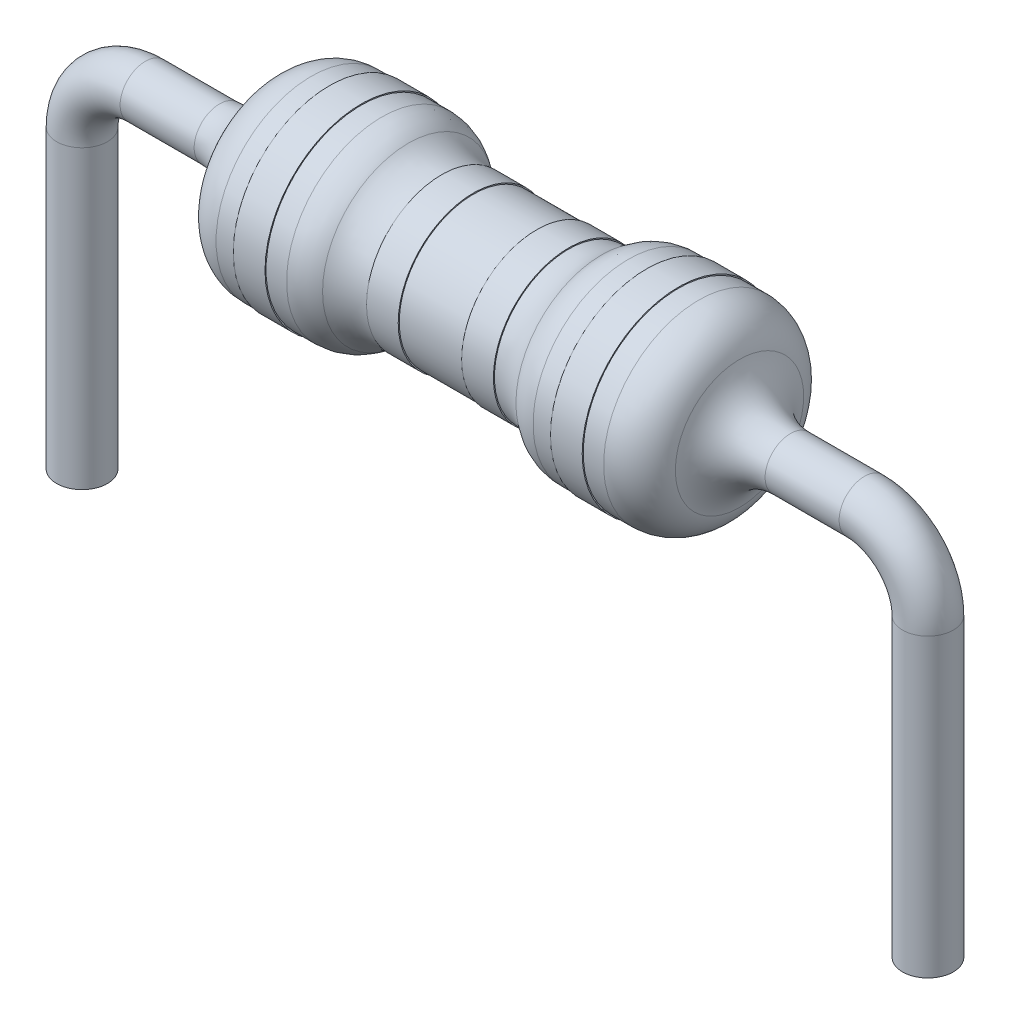
ISO-10303-21;
HEADER;
FILE_DESCRIPTION(('STEP AP214'),'2;1');
FILE_NAME('part.step','',(''),(''),'','','');
FILE_SCHEMA(('AUTOMOTIVE_DESIGN { 1 0 10303 214 1 1 1 1 }'));
ENDSEC;
DATA;
#1=APPLICATION_CONTEXT('core data for automotive mechanical design processes');
#2=APPLICATION_PROTOCOL_DEFINITION('international standard','automotive_design',2000,#1);
#3=PRODUCT_CONTEXT('',#1,'mechanical');
#4=PRODUCT('Part','Part','',(#3));
#5=PRODUCT_RELATED_PRODUCT_CATEGORY('part','',(#4));
#6=PRODUCT_DEFINITION_FORMATION('','',#4);
#7=PRODUCT_DEFINITION_CONTEXT('part definition',#1,'design');
#8=PRODUCT_DEFINITION('design','',#6,#7);
#9=PRODUCT_DEFINITION_SHAPE('','',#8);
#10=(LENGTH_UNIT() NAMED_UNIT(*) SI_UNIT(.MILLI.,.METRE.));
#11=(NAMED_UNIT(*) PLANE_ANGLE_UNIT() SI_UNIT($,.RADIAN.));
#12=(NAMED_UNIT(*) SI_UNIT($,.STERADIAN.) SOLID_ANGLE_UNIT());
#13=UNCERTAINTY_MEASURE_WITH_UNIT(LENGTH_MEASURE(1.E-05),#10,'distance_accuracy_value','');
#14=(GEOMETRIC_REPRESENTATION_CONTEXT(3) GLOBAL_UNCERTAINTY_ASSIGNED_CONTEXT((#13)) GLOBAL_UNIT_ASSIGNED_CONTEXT((#10,
#11,#12)) REPRESENTATION_CONTEXT('',''));
#15=CARTESIAN_POINT('',(0.,0.,0.));
#16=DIRECTION('',(0.,0.,1.));
#17=DIRECTION('',(1.,0.,0.));
#18=AXIS2_PLACEMENT_3D('',#15,#16,#17);
#19=CARTESIAN_POINT('',(-3.21695881901281,1.778,0.));
#20=DIRECTION('',(-1.,0.,0.));
#21=DIRECTION('',(0.,0.,1.));
#22=AXIS2_PLACEMENT_3D('',#19,#20,#21);
#23=CYLINDRICAL_SURFACE('',#22,1.143);
#24=CARTESIAN_POINT('',(6.56042048968553,1.778,0.));
#25=DIRECTION('',(1.,0.,0.));
#26=DIRECTION('',(0.,0.,-1.));
#27=AXIS2_PLACEMENT_3D('',#24,#25,#26);
#28=CIRCLE('',#27,1.143);
#29=CARTESIAN_POINT('',(6.56042048968553,1.778,-1.143));
#30=VERTEX_POINT('',#29);
#31=EDGE_CURVE('E97',#30,#30,#28,.T.);
#32=ORIENTED_EDGE('',*,*,#31,.T.);
#33=EDGE_LOOP('',(#32));
#34=FACE_BOUND('',#33,.T.);
#35=CARTESIAN_POINT('',(6.7818,1.778,0.));
#36=DIRECTION('',(1.,0.,0.));
#37=DIRECTION('',(0.,0.,-1.));
#38=AXIS2_PLACEMENT_3D('',#35,#36,#37);
#39=CIRCLE('',#38,1.143);
#40=CARTESIAN_POINT('',(6.7818,1.778,-1.143));
#41=VERTEX_POINT('',#40);
#42=EDGE_CURVE('E158',#41,#41,#39,.T.);
#43=ORIENTED_EDGE('',*,*,#42,.F.);
#44=EDGE_LOOP('',(#43));
#45=FACE_BOUND('',#44,.T.);
#46=ADVANCED_FACE('F59',(#34,#45),#23,.T.);
#47=CARTESIAN_POINT('',(-3.21695881901281,1.778,0.));
#48=DIRECTION('',(-1.,0.,0.));
#49=DIRECTION('',(0.,0.,1.));
#50=AXIS2_PLACEMENT_3D('',#47,#48,#49);
#51=CYLINDRICAL_SURFACE('',#50,0.889);
#52=CARTESIAN_POINT('',(4.699,1.778,0.));
#53=DIRECTION('',(1.,0.,0.));
#54=DIRECTION('',(0.,0.,-1.));
#55=AXIS2_PLACEMENT_3D('',#52,#53,#54);
#56=CIRCLE('',#55,0.889);
#57=CARTESIAN_POINT('',(4.699,1.778,-0.889));
#58=VERTEX_POINT('',#57);
#59=EDGE_CURVE('E66',#58,#58,#56,.F.);
#60=ORIENTED_EDGE('',*,*,#59,.F.);
#61=EDGE_LOOP('',(#60));
#62=FACE_BOUND('',#61,.T.);
#63=CARTESIAN_POINT('',(5.461,1.778,0.));
#64=DIRECTION('',(1.,0.,0.));
#65=DIRECTION('',(0.,0.,-1.));
#66=AXIS2_PLACEMENT_3D('',#63,#64,#65);
#67=CIRCLE('',#66,0.889);
#68=CARTESIAN_POINT('',(5.461,1.778,-0.889));
#69=VERTEX_POINT('',#68);
#70=EDGE_CURVE('E149',#69,#69,#67,.T.);
#71=ORIENTED_EDGE('',*,*,#70,.F.);
#72=EDGE_LOOP('',(#71));
#73=FACE_BOUND('',#72,.T.);
#74=ADVANCED_FACE('F167',(#62,#73),#51,.T.);
#75=CARTESIAN_POINT('',(-3.21695881901281,1.778,0.));
#76=DIRECTION('',(-1.,0.,0.));
#77=DIRECTION('',(0.,0.,1.));
#78=AXIS2_PLACEMENT_3D('',#75,#76,#77);
#79=CYLINDRICAL_SURFACE('',#78,1.143);
#80=CARTESIAN_POINT('',(3.3528,1.778,0.));
#81=DIRECTION('',(1.,0.,0.));
#82=DIRECTION('',(0.,0.,-1.));
#83=AXIS2_PLACEMENT_3D('',#80,#81,#82);
#84=CIRCLE('',#83,1.143);
#85=CARTESIAN_POINT('',(3.3528,1.778,-1.143));
#86=VERTEX_POINT('',#85);
#87=EDGE_CURVE('E70',#86,#86,#84,.F.);
#88=ORIENTED_EDGE('',*,*,#87,.F.);
#89=EDGE_LOOP('',(#88));
#90=FACE_BOUND('',#89,.T.);
#91=CARTESIAN_POINT('',(3.59957951031447,1.778,0.));
#92=DIRECTION('',(1.,0.,0.));
#93=DIRECTION('',(0.,0.,-1.));
#94=AXIS2_PLACEMENT_3D('',#91,#92,#93);
#95=CIRCLE('',#94,1.143);
#96=CARTESIAN_POINT('',(3.59957951031447,1.778,-1.143));
#97=VERTEX_POINT('',#96);
#98=EDGE_CURVE('E82',#97,#97,#95,.F.);
#99=ORIENTED_EDGE('',*,*,#98,.T.);
#100=EDGE_LOOP('',(#99));
#101=FACE_BOUND('',#100,.T.);
#102=ADVANCED_FACE('F174',(#90,#101),#79,.T.);
#103=CARTESIAN_POINT('',(4.318,1.778,0.));
#104=DIRECTION('',(-1.,0.,0.));
#105=DIRECTION('',(0.,0.,1.));
#106=AXIS2_PLACEMENT_3D('',#103,#104,#105);
#107=TOROIDAL_SURFACE('',#106,1.524,0.635);
#108=CARTESIAN_POINT('',(3.91887750573026,1.778,0.));
#109=DIRECTION('',(1.,0.,0.));
#110=DIRECTION('',(0.,0.,-1.));
#111=AXIS2_PLACEMENT_3D('',#108,#109,#110);
#112=CIRCLE('',#111,1.03011111111111);
#113=CARTESIAN_POINT('',(3.91887750573026,1.778,-1.03011111111111));
#114=VERTEX_POINT('',#113);
#115=EDGE_CURVE('E79',#114,#114,#112,.T.);
#116=ORIENTED_EDGE('',*,*,#115,.T.);
#117=EDGE_LOOP('',(#116));
#118=FACE_BOUND('',#117,.T.);
#119=CARTESIAN_POINT('',(4.318,1.778,0.));
#120=DIRECTION('',(-1.,0.,0.));
#121=DIRECTION('',(0.,0.,1.));
#122=AXIS2_PLACEMENT_3D('',#119,#120,#121);
#123=CIRCLE('',#122,0.889);
#124=CARTESIAN_POINT('',(4.318,1.778,0.889));
#125=VERTEX_POINT('',#124);
#126=EDGE_CURVE('E106',#125,#125,#123,.F.);
#127=ORIENTED_EDGE('',*,*,#126,.F.);
#128=EDGE_LOOP('',(#127));
#129=FACE_BOUND('',#128,.T.);
#130=ADVANCED_FACE('F209',(#118,#129),#107,.F.);
#131=CARTESIAN_POINT('',(3.59957951031447,1.778,0.));
#132=DIRECTION('',(1.,0.,0.));
#133=DIRECTION('',(0.,0.,-1.));
#134=AXIS2_PLACEMENT_3D('',#131,#132,#133);
#135=TOROIDAL_SURFACE('',#134,0.635,0.508);
#136=ORIENTED_EDGE('',*,*,#115,.F.);
#137=EDGE_LOOP('',(#136));
#138=FACE_BOUND('',#137,.T.);
#139=ORIENTED_EDGE('',*,*,#98,.F.);
#140=EDGE_LOOP('',(#139));
#141=FACE_BOUND('',#140,.T.);
#142=ADVANCED_FACE('F206',(#138,#141),#135,.T.);
#143=CARTESIAN_POINT('',(3.3528,1.778,0.));
#144=DIRECTION('',(1.,0.,0.));
#145=DIRECTION('',(0.,0.,-1.));
#146=AXIS2_PLACEMENT_3D('',#143,#144,#145);
#147=PLANE('',#146);
#148=CARTESIAN_POINT('',(3.3528,1.778,0.));
#149=DIRECTION('',(1.,0.,0.));
#150=DIRECTION('',(0.,0.,-1.));
#151=AXIS2_PLACEMENT_3D('',#148,#149,#150);
#152=CIRCLE('',#151,1.1557);
#153=CARTESIAN_POINT('',(3.3528,1.778,1.1557));
#154=VERTEX_POINT('',#153);
#155=EDGE_CURVE('E128',#154,#154,#152,.T.);
#156=ORIENTED_EDGE('',*,*,#155,.T.);
#157=EDGE_LOOP('',(#156));
#158=FACE_BOUND('',#157,.T.);
#159=ORIENTED_EDGE('',*,*,#87,.T.);
#160=EDGE_LOOP('',(#159));
#161=FACE_BOUND('',#160,.T.);
#162=ADVANCED_FACE('F208',(#158,#161),#147,.T.);
#163=CARTESIAN_POINT('',(2.9718,1.778,0.));
#164=DIRECTION('',(1.,0.,0.));
#165=DIRECTION('',(0.,0.,-1.));
#166=AXIS2_PLACEMENT_3D('',#163,#164,#165);
#167=PLANE('',#166);
#168=CARTESIAN_POINT('',(2.9718,1.778,0.));
#169=DIRECTION('',(1.,0.,0.));
#170=DIRECTION('',(0.,0.,-1.));
#171=AXIS2_PLACEMENT_3D('',#168,#169,#170);
#172=CIRCLE('',#171,1.1557);
#173=CARTESIAN_POINT('',(2.9718,1.778,1.1557));
#174=VERTEX_POINT('',#173);
#175=EDGE_CURVE('E131',#174,#174,#172,.T.);
#176=ORIENTED_EDGE('',*,*,#175,.F.);
#177=EDGE_LOOP('',(#176));
#178=FACE_BOUND('',#177,.T.);
#179=CARTESIAN_POINT('',(2.9718,1.778,0.));
#180=DIRECTION('',(1.,0.,0.));
#181=DIRECTION('',(0.,0.,-1.));
#182=AXIS2_PLACEMENT_3D('',#179,#180,#181);
#183=CIRCLE('',#182,1.143);
#184=CARTESIAN_POINT('',(2.9718,1.778,-1.143));
#185=VERTEX_POINT('',#184);
#186=EDGE_CURVE('E134',#185,#185,#183,.T.);
#187=ORIENTED_EDGE('',*,*,#186,.T.);
#188=EDGE_LOOP('',(#187));
#189=FACE_BOUND('',#188,.T.);
#190=ADVANCED_FACE('F215',(#178,#189),#167,.F.);
#191=CARTESIAN_POINT('',(3.3528,1.778,0.));
#192=DIRECTION('',(-1.,0.,0.));
#193=DIRECTION('',(0.,0.,1.));
#194=AXIS2_PLACEMENT_3D('',#191,#192,#193);
#195=CYLINDRICAL_SURFACE('',#194,1.1557);
#196=CARTESIAN_POINT('',(3.3528,1.778,1.1557));
#197=CARTESIAN_POINT('',(3.34883125,1.778,1.1557));
#198=CARTESIAN_POINT('',(3.3448625,1.778,1.1557));
#199=CARTESIAN_POINT('',(3.336925,1.778,1.1557));
#200=CARTESIAN_POINT('',(3.33295625,1.778,1.1557));
#201=CARTESIAN_POINT('',(3.32501875,1.778,1.1557));
#202=CARTESIAN_POINT('',(3.32105,1.778,1.1557));
#203=CARTESIAN_POINT('',(3.3131125,1.778,1.1557));
#204=CARTESIAN_POINT('',(3.30914375,1.778,1.1557));
#205=CARTESIAN_POINT('',(3.30120625,1.778,1.1557));
#206=CARTESIAN_POINT('',(3.2972375,1.778,1.1557));
#207=CARTESIAN_POINT('',(3.2893,1.778,1.1557));
#208=CARTESIAN_POINT('',(3.28533125,1.778,1.1557));
#209=CARTESIAN_POINT('',(3.27739375,1.778,1.1557));
#210=CARTESIAN_POINT('',(3.273425,1.778,1.1557));
#211=CARTESIAN_POINT('',(3.2654875,1.778,1.1557));
#212=CARTESIAN_POINT('',(3.26151875,1.778,1.1557));
#213=CARTESIAN_POINT('',(3.25358125,1.778,1.1557));
#214=CARTESIAN_POINT('',(3.2496125,1.778,1.1557));
#215=CARTESIAN_POINT('',(3.241675,1.778,1.1557));
#216=CARTESIAN_POINT('',(3.23770625,1.778,1.1557));
#217=CARTESIAN_POINT('',(3.22976875,1.778,1.1557));
#218=CARTESIAN_POINT('',(3.2258,1.778,1.1557));
#219=CARTESIAN_POINT('',(3.2178625,1.778,1.1557));
#220=CARTESIAN_POINT('',(3.21389375,1.778,1.1557));
#221=CARTESIAN_POINT('',(3.20595625,1.778,1.1557));
#222=CARTESIAN_POINT('',(3.2019875,1.778,1.1557));
#223=CARTESIAN_POINT('',(3.19405,1.778,1.1557));
#224=CARTESIAN_POINT('',(3.19008125,1.778,1.1557));
#225=CARTESIAN_POINT('',(3.18214375,1.778,1.1557));
#226=CARTESIAN_POINT('',(3.178175,1.778,1.1557));
#227=CARTESIAN_POINT('',(3.1702375,1.778,1.1557));
#228=CARTESIAN_POINT('',(3.16626875,1.778,1.1557));
#229=CARTESIAN_POINT('',(3.15833125,1.778,1.1557));
#230=CARTESIAN_POINT('',(3.1543625,1.778,1.1557));
#231=CARTESIAN_POINT('',(3.146425,1.778,1.1557));
#232=CARTESIAN_POINT('',(3.14245625,1.778,1.1557));
#233=CARTESIAN_POINT('',(3.13451875,1.778,1.1557));
#234=CARTESIAN_POINT('',(3.13055,1.778,1.1557));
#235=CARTESIAN_POINT('',(3.1226125,1.778,1.1557));
#236=CARTESIAN_POINT('',(3.11864375,1.778,1.1557));
#237=CARTESIAN_POINT('',(3.11070625,1.778,1.1557));
#238=CARTESIAN_POINT('',(3.1067375,1.778,1.1557));
#239=CARTESIAN_POINT('',(3.0988,1.778,1.1557));
#240=CARTESIAN_POINT('',(3.09483125,1.778,1.1557));
#241=CARTESIAN_POINT('',(3.08689375,1.778,1.1557));
#242=CARTESIAN_POINT('',(3.082925,1.778,1.1557));
#243=CARTESIAN_POINT('',(3.0749875,1.778,1.1557));
#244=CARTESIAN_POINT('',(3.07101875,1.778,1.1557));
#245=CARTESIAN_POINT('',(3.06308125,1.778,1.1557));
#246=CARTESIAN_POINT('',(3.0591125,1.778,1.1557));
#247=CARTESIAN_POINT('',(3.051175,1.778,1.1557));
#248=CARTESIAN_POINT('',(3.04720625,1.778,1.1557));
#249=CARTESIAN_POINT('',(3.03926875,1.778,1.1557));
#250=CARTESIAN_POINT('',(3.0353,1.778,1.1557));
#251=CARTESIAN_POINT('',(3.0273625,1.778,1.1557));
#252=CARTESIAN_POINT('',(3.02339375,1.778,1.1557));
#253=CARTESIAN_POINT('',(3.01545625,1.778,1.1557));
#254=CARTESIAN_POINT('',(3.0114875,1.778,1.1557));
#255=CARTESIAN_POINT('',(3.00355,1.778,1.1557));
#256=CARTESIAN_POINT('',(2.99958125,1.778,1.1557));
#257=CARTESIAN_POINT('',(2.99164375,1.778,1.1557));
#258=CARTESIAN_POINT('',(2.987675,1.778,1.1557));
#259=CARTESIAN_POINT('',(2.9797375,1.778,1.1557));
#260=CARTESIAN_POINT('',(2.97576875,1.778,1.1557));
#261=CARTESIAN_POINT('',(2.9718,1.778,1.1557));
#262=B_SPLINE_CURVE_WITH_KNOTS('',3,(#196,#197,#198,#199,#200,#201,#202,#203,#204,#205,#206,
#207,#208,#209,#210,#211,#212,#213,#214,#215,#216,#217,#218,#219,#220,#221,#222,#223,#224,#225,
#226,#227,#228,#229,#230,#231,#232,#233,#234,#235,#236,#237,#238,#239,#240,#241,#242,#243,#244,
#245,#246,#247,#248,#249,#250,#251,#252,#253,#254,#255,#256,#257,#258,#259,#260,#261),
.UNSPECIFIED.,.F.,.F.,(4,2,2,2,2,2,2,2,2,2,2,2,2,2,2,2,2,2,2,2,2,2,2,2,2,2,2,2,2,2,2,2,4),(0.,
0.0119062500000002,0.0238125000000004,0.0357187500000002,0.0476250000000004,0.0595312500000001,
0.0714375000000003,0.0833437500000001,0.0952500000000003,0.10715625,0.1190625,0.13096875,
0.142875,0.15478125,0.1666875,0.17859375,0.1905,0.20240625,0.2143125,0.22621875,0.238125,
0.25003125,0.2619375,0.27384375,0.28575,0.29765625,0.3095625,0.32146875,0.333375,0.34528125,
0.3571875,0.36909375,0.381),.UNSPECIFIED.);
#263=EDGE_CURVE('BSEAM247',#154,#174,#262,.T.);
#264=ORIENTED_EDGE('',*,*,#155,.F.);
#265=ORIENTED_EDGE('',*,*,#175,.T.);
#266=ORIENTED_EDGE('',*,*,#263,.T.);
#267=ORIENTED_EDGE('',*,*,#263,.F.);
#268=EDGE_LOOP('',(#264,#266,#265,#267));
#269=FACE_BOUND('',#268,.T.);
#270=ADVANCED_FACE('F247',(#269),#195,.T.);
#271=CARTESIAN_POINT('',(0.,-2.54,0.));
#272=DIRECTION('',(0.,1.,0.));
#273=DIRECTION('',(0.,0.,1.));
#274=AXIS2_PLACEMENT_3D('',#271,#272,#273);
#275=PLANE('',#274);
#276=CARTESIAN_POINT('',(0.,-2.54,0.));
#277=DIRECTION('',(0.,1.,0.));
#278=DIRECTION('',(0.,0.,1.));
#279=AXIS2_PLACEMENT_3D('',#276,#277,#278);
#280=CIRCLE('',#279,0.3048);
#281=CARTESIAN_POINT('',(0.,-2.54,0.3048));
#282=VERTEX_POINT('',#281);
#283=EDGE_CURVE('E125',#282,#282,#280,.T.);
#284=ORIENTED_EDGE('',*,*,#283,.F.);
#285=EDGE_LOOP('',(#284));
#286=FACE_BOUND('',#285,.T.);
#287=ADVANCED_FACE('F253',(#286),#275,.F.);
#288=CARTESIAN_POINT('',(0.,1.016,0.));
#289=DIRECTION('',(0.,-1.,0.));
#290=DIRECTION('',(0.,0.,-1.));
#291=AXIS2_PLACEMENT_3D('',#288,#289,#290);
#292=CYLINDRICAL_SURFACE('',#291,0.3048);
#293=CARTESIAN_POINT('',(0.,1.016,0.));
#294=DIRECTION('',(0.,1.,0.));
#295=DIRECTION('',(0.,0.,1.));
#296=AXIS2_PLACEMENT_3D('',#293,#294,#295);
#297=CIRCLE('',#296,0.3048);
#298=CARTESIAN_POINT('',(-0.3048,1.016,0.));
#299=VERTEX_POINT('',#298);
#300=EDGE_CURVE('E124',#299,#299,#297,.T.);
#301=ORIENTED_EDGE('',*,*,#300,.F.);
#302=EDGE_LOOP('',(#301));
#303=FACE_BOUND('',#302,.T.);
#304=ORIENTED_EDGE('',*,*,#283,.T.);
#305=EDGE_LOOP('',(#304));
#306=FACE_BOUND('',#305,.T.);
#307=ADVANCED_FACE('F313',(#303,#306),#292,.T.);
#308=CARTESIAN_POINT('',(0.762,1.016,0.));
#309=DIRECTION('',(0.,0.,-1.));
#310=DIRECTION('',(-1.,0.,0.));
#311=AXIS2_PLACEMENT_3D('',#308,#309,#310);
#312=TOROIDAL_SURFACE('',#311,0.762,0.3048);
#313=CARTESIAN_POINT('',(0.762,1.778,0.));
#314=DIRECTION('',(1.,0.,0.));
#315=DIRECTION('',(0.,0.,1.));
#316=AXIS2_PLACEMENT_3D('',#313,#314,#315);
#317=CIRCLE('',#316,0.3048);
#318=CARTESIAN_POINT('',(0.762,2.0828,0.));
#319=VERTEX_POINT('',#318);
#320=EDGE_CURVE('E121',#319,#319,#317,.T.);
#321=CARTESIAN_POINT('',(0.762,1.016,0.));
#322=DIRECTION('',(0.,0.,-1.));
#323=DIRECTION('',(-1.,0.,0.));
#324=AXIS2_PLACEMENT_3D('',#321,#322,#323);
#325=CIRCLE('',#324,1.0668);
#326=EDGE_CURVE('',#299,#319,#325,.T.);
#327=ORIENTED_EDGE('',*,*,#300,.T.);
#328=ORIENTED_EDGE('',*,*,#320,.F.);
#329=ORIENTED_EDGE('',*,*,#326,.T.);
#330=ORIENTED_EDGE('',*,*,#326,.F.);
#331=EDGE_LOOP('',(#327,#329,#328,#330));
#332=FACE_BOUND('',#331,.T.);
#333=ADVANCED_FACE('F309',(#332),#312,.T.);
#334=CARTESIAN_POINT('',(0.762,1.778,0.));
#335=DIRECTION('',(1.,0.,0.));
#336=DIRECTION('',(0.,1.,0.));
#337=AXIS2_PLACEMENT_3D('',#334,#335,#336);
#338=CYLINDRICAL_SURFACE('',#337,0.3048);
#339=CARTESIAN_POINT('',(1.651,1.778,0.));
#340=DIRECTION('',(-1.,0.,0.));
#341=DIRECTION('',(0.,0.,1.));
#342=AXIS2_PLACEMENT_3D('',#339,#340,#341);
#343=CIRCLE('',#342,0.3048);
#344=CARTESIAN_POINT('',(1.651,1.778,0.3048));
#345=VERTEX_POINT('',#344);
#346=EDGE_CURVE('E100',#345,#345,#343,.T.);
#347=ORIENTED_EDGE('',*,*,#346,.T.);
#348=EDGE_LOOP('',(#347));
#349=FACE_BOUND('',#348,.T.);
#350=ORIENTED_EDGE('',*,*,#320,.T.);
#351=EDGE_LOOP('',(#350));
#352=FACE_BOUND('',#351,.T.);
#353=ADVANCED_FACE('F306',(#349,#352),#338,.T.);
#354=CARTESIAN_POINT('',(1.651,1.778,0.));
#355=DIRECTION('',(-1.,0.,0.));
#356=DIRECTION('',(0.,0.,1.));
#357=AXIS2_PLACEMENT_3D('',#354,#355,#356);
#358=TOROIDAL_SURFACE('',#357,0.9398,0.635);
#359=CARTESIAN_POINT('',(2.2630059004799,1.778,0.));
#360=DIRECTION('',(-1.,0.,0.));
#361=DIRECTION('',(0.,0.,1.));
#362=AXIS2_PLACEMENT_3D('',#359,#360,#361);
#363=CIRCLE('',#362,0.770466666666668);
#364=CARTESIAN_POINT('',(2.2630059004799,1.778,0.770466666666668));
#365=VERTEX_POINT('',#364);
#366=EDGE_CURVE('E74',#365,#365,#363,.T.);
#367=ORIENTED_EDGE('',*,*,#366,.T.);
#368=EDGE_LOOP('',(#367));
#369=FACE_BOUND('',#368,.T.);
#370=ORIENTED_EDGE('',*,*,#346,.F.);
#371=EDGE_LOOP('',(#370));
#372=FACE_BOUND('',#371,.T.);
#373=ADVANCED_FACE('F199',(#369,#372),#358,.F.);
#374=CARTESIAN_POINT('',(2.75261062086383,1.778,0.));
#375=DIRECTION('',(1.,0.,0.));
#376=DIRECTION('',(0.,0.,-1.));
#377=AXIS2_PLACEMENT_3D('',#374,#375,#376);
#378=TOROIDAL_SURFACE('',#377,0.635,0.508);
#379=CARTESIAN_POINT('',(2.75261062086383,1.778,0.));
#380=DIRECTION('',(1.,0.,0.));
#381=DIRECTION('',(0.,0.,-1.));
#382=AXIS2_PLACEMENT_3D('',#379,#380,#381);
#383=CIRCLE('',#382,1.143);
#384=CARTESIAN_POINT('',(2.75261062086383,1.778,-1.143));
#385=VERTEX_POINT('',#384);
#386=EDGE_CURVE('E85',#385,#385,#383,.T.);
#387=ORIENTED_EDGE('',*,*,#386,.F.);
#388=EDGE_LOOP('',(#387));
#389=FACE_BOUND('',#388,.T.);
#390=ORIENTED_EDGE('',*,*,#366,.F.);
#391=EDGE_LOOP('',(#390));
#392=FACE_BOUND('',#391,.T.);
#393=ADVANCED_FACE('F61',(#389,#392),#378,.T.);
#394=ORIENTED_EDGE('',*,*,#386,.T.);
#395=EDGE_LOOP('',(#394));
#396=FACE_BOUND('',#395,.T.);
#397=ORIENTED_EDGE('',*,*,#186,.F.);
#398=EDGE_LOOP('',(#397));
#399=FACE_BOUND('',#398,.T.);
#400=ADVANCED_FACE('F226',(#396,#399),#79,.T.);
#401=CARTESIAN_POINT('',(4.699,1.778,0.));
#402=DIRECTION('',(1.,0.,0.));
#403=DIRECTION('',(0.,0.,-1.));
#404=AXIS2_PLACEMENT_3D('',#401,#402,#403);
#405=PLANE('',#404);
#406=CARTESIAN_POINT('',(4.699,1.778,0.));
#407=DIRECTION('',(1.,0.,0.));
#408=DIRECTION('',(0.,0.,-1.));
#409=AXIS2_PLACEMENT_3D('',#406,#407,#408);
#410=CIRCLE('',#409,0.9017);
#411=CARTESIAN_POINT('',(4.699,1.778,0.9017));
#412=VERTEX_POINT('',#411);
#413=EDGE_CURVE('E139',#412,#412,#410,.T.);
#414=ORIENTED_EDGE('',*,*,#413,.T.);
#415=EDGE_LOOP('',(#414));
#416=FACE_BOUND('',#415,.T.);
#417=ORIENTED_EDGE('',*,*,#59,.T.);
#418=EDGE_LOOP('',(#417));
#419=FACE_BOUND('',#418,.T.);
#420=ADVANCED_FACE('F232',(#416,#419),#405,.T.);
#421=CARTESIAN_POINT('',(4.318,1.778,0.));
#422=DIRECTION('',(1.,0.,0.));
#423=DIRECTION('',(0.,0.,-1.));
#424=AXIS2_PLACEMENT_3D('',#421,#422,#423);
#425=PLANE('',#424);
#426=CARTESIAN_POINT('',(4.318,1.778,0.));
#427=DIRECTION('',(1.,0.,0.));
#428=DIRECTION('',(0.,0.,-1.));
#429=AXIS2_PLACEMENT_3D('',#426,#427,#428);
#430=CIRCLE('',#429,0.9017);
#431=CARTESIAN_POINT('',(4.318,1.778,0.9017));
#432=VERTEX_POINT('',#431);
#433=EDGE_CURVE('E140',#432,#432,#430,.T.);
#434=ORIENTED_EDGE('',*,*,#433,.F.);
#435=EDGE_LOOP('',(#434));
#436=FACE_BOUND('',#435,.T.);
#437=ORIENTED_EDGE('',*,*,#126,.T.);
#438=EDGE_LOOP('',(#437));
#439=FACE_BOUND('',#438,.T.);
#440=ADVANCED_FACE('F238',(#436,#439),#425,.F.);
#441=CARTESIAN_POINT('',(4.699,1.778,0.));
#442=DIRECTION('',(-1.,0.,0.));
#443=DIRECTION('',(0.,0.,1.));
#444=AXIS2_PLACEMENT_3D('',#441,#442,#443);
#445=CYLINDRICAL_SURFACE('',#444,0.9017);
#446=CARTESIAN_POINT('',(4.699,1.778,0.9017));
#447=CARTESIAN_POINT('',(4.69503125,1.778,0.9017));
#448=CARTESIAN_POINT('',(4.6910625,1.778,0.9017));
#449=CARTESIAN_POINT('',(4.683125,1.778,0.9017));
#450=CARTESIAN_POINT('',(4.67915625,1.778,0.9017));
#451=CARTESIAN_POINT('',(4.67121875,1.778,0.9017));
#452=CARTESIAN_POINT('',(4.66725,1.778,0.9017));
#453=CARTESIAN_POINT('',(4.6593125,1.778,0.9017));
#454=CARTESIAN_POINT('',(4.65534375,1.778,0.9017));
#455=CARTESIAN_POINT('',(4.64740625,1.778,0.9017));
#456=CARTESIAN_POINT('',(4.6434375,1.778,0.9017));
#457=CARTESIAN_POINT('',(4.6355,1.778,0.9017));
#458=CARTESIAN_POINT('',(4.63153125,1.778,0.9017));
#459=CARTESIAN_POINT('',(4.62359375,1.778,0.9017));
#460=CARTESIAN_POINT('',(4.619625,1.778,0.9017));
#461=CARTESIAN_POINT('',(4.6116875,1.778,0.9017));
#462=CARTESIAN_POINT('',(4.60771875,1.778,0.9017));
#463=CARTESIAN_POINT('',(4.59978125,1.778,0.9017));
#464=CARTESIAN_POINT('',(4.5958125,1.778,0.9017));
#465=CARTESIAN_POINT('',(4.587875,1.778,0.9017));
#466=CARTESIAN_POINT('',(4.58390625,1.778,0.9017));
#467=CARTESIAN_POINT('',(4.57596875,1.778,0.9017));
#468=CARTESIAN_POINT('',(4.572,1.778,0.9017));
#469=CARTESIAN_POINT('',(4.5640625,1.778,0.9017));
#470=CARTESIAN_POINT('',(4.56009375,1.778,0.9017));
#471=CARTESIAN_POINT('',(4.55215625,1.778,0.9017));
#472=CARTESIAN_POINT('',(4.5481875,1.778,0.9017));
#473=CARTESIAN_POINT('',(4.54025,1.778,0.9017));
#474=CARTESIAN_POINT('',(4.53628125,1.778,0.9017));
#475=CARTESIAN_POINT('',(4.52834375,1.778,0.9017));
#476=CARTESIAN_POINT('',(4.524375,1.778,0.9017));
#477=CARTESIAN_POINT('',(4.5164375,1.778,0.9017));
#478=CARTESIAN_POINT('',(4.51246875,1.778,0.9017));
#479=CARTESIAN_POINT('',(4.50453125,1.778,0.9017));
#480=CARTESIAN_POINT('',(4.5005625,1.778,0.9017));
#481=CARTESIAN_POINT('',(4.492625,1.778,0.9017));
#482=CARTESIAN_POINT('',(4.48865625,1.778,0.9017));
#483=CARTESIAN_POINT('',(4.48071875,1.778,0.9017));
#484=CARTESIAN_POINT('',(4.47675,1.778,0.9017));
#485=CARTESIAN_POINT('',(4.4688125,1.778,0.9017));
#486=CARTESIAN_POINT('',(4.46484375,1.778,0.9017));
#487=CARTESIAN_POINT('',(4.45690625,1.778,0.9017));
#488=CARTESIAN_POINT('',(4.4529375,1.778,0.9017));
#489=CARTESIAN_POINT('',(4.445,1.778,0.9017));
#490=CARTESIAN_POINT('',(4.44103125,1.778,0.9017));
#491=CARTESIAN_POINT('',(4.43309375,1.778,0.9017));
#492=CARTESIAN_POINT('',(4.429125,1.778,0.9017));
#493=CARTESIAN_POINT('',(4.4211875,1.778,0.9017));
#494=CARTESIAN_POINT('',(4.41721875,1.778,0.9017));
#495=CARTESIAN_POINT('',(4.40928125,1.778,0.9017));
#496=CARTESIAN_POINT('',(4.4053125,1.778,0.9017));
#497=CARTESIAN_POINT('',(4.397375,1.778,0.9017));
#498=CARTESIAN_POINT('',(4.39340625,1.778,0.9017));
#499=CARTESIAN_POINT('',(4.38546875,1.778,0.9017));
#500=CARTESIAN_POINT('',(4.3815,1.778,0.9017));
#501=CARTESIAN_POINT('',(4.3735625,1.778,0.9017));
#502=CARTESIAN_POINT('',(4.36959375,1.778,0.9017));
#503=CARTESIAN_POINT('',(4.36165625,1.778,0.9017));
#504=CARTESIAN_POINT('',(4.3576875,1.778,0.9017));
#505=CARTESIAN_POINT('',(4.34975,1.778,0.9017));
#506=CARTESIAN_POINT('',(4.34578125,1.778,0.9017));
#507=CARTESIAN_POINT('',(4.33784375,1.778,0.9017));
#508=CARTESIAN_POINT('',(4.333875,1.778,0.9017));
#509=CARTESIAN_POINT('',(4.3259375,1.778,0.9017));
#510=CARTESIAN_POINT('',(4.32196875,1.778,0.9017));
#511=CARTESIAN_POINT('',(4.318,1.778,0.9017));
#512=B_SPLINE_CURVE_WITH_KNOTS('',3,(#446,#447,#448,#449,#450,#451,#452,#453,#454,#455,#456,
#457,#458,#459,#460,#461,#462,#463,#464,#465,#466,#467,#468,#469,#470,#471,#472,#473,#474,#475,
#476,#477,#478,#479,#480,#481,#482,#483,#484,#485,#486,#487,#488,#489,#490,#491,#492,#493,#494,
#495,#496,#497,#498,#499,#500,#501,#502,#503,#504,#505,#506,#507,#508,#509,#510,#511),
.UNSPECIFIED.,.F.,.F.,(4,2,2,2,2,2,2,2,2,2,2,2,2,2,2,2,2,2,2,2,2,2,2,2,2,2,2,2,2,2,2,2,4),(0.,
0.0119062499999998,0.0238124999999995,0.0357187499999993,0.0476249999999999,0.0595312499999997,
0.0714374999999995,0.0833437499999992,0.0952499999999998,0.10715625,0.119062499999999,
0.13096875,0.142875,0.15478125,0.166687499999999,0.17859375,0.1905,0.202406249999999,0.2143125,
0.22621875,0.238125,0.250031249999999,0.2619375,0.27384375,0.28575,0.297656249999999,0.3095625,
0.32146875,0.333374999999999,0.34528125,0.3571875,0.36909375,0.380999999999999),.UNSPECIFIED.);
#513=EDGE_CURVE('BSEAM257',#412,#432,#512,.T.);
#514=ORIENTED_EDGE('',*,*,#413,.F.);
#515=ORIENTED_EDGE('',*,*,#433,.T.);
#516=ORIENTED_EDGE('',*,*,#513,.T.);
#517=ORIENTED_EDGE('',*,*,#513,.F.);
#518=EDGE_LOOP('',(#514,#516,#515,#517));
#519=FACE_BOUND('',#518,.T.);
#520=ADVANCED_FACE('F257',(#519),#445,.T.);
#521=CARTESIAN_POINT('',(5.842,1.778,0.));
#522=DIRECTION('',(1.,0.,0.));
#523=DIRECTION('',(0.,0.,-1.));
#524=AXIS2_PLACEMENT_3D('',#521,#522,#523);
#525=PLANE('',#524);
#526=CARTESIAN_POINT('',(5.842,1.778,0.));
#527=DIRECTION('',(1.,0.,0.));
#528=DIRECTION('',(0.,0.,-1.));
#529=AXIS2_PLACEMENT_3D('',#526,#527,#528);
#530=CIRCLE('',#529,0.9017);
#531=CARTESIAN_POINT('',(5.842,1.778,0.9017));
#532=VERTEX_POINT('',#531);
#533=EDGE_CURVE('E143',#532,#532,#530,.T.);
#534=ORIENTED_EDGE('',*,*,#533,.T.);
#535=EDGE_LOOP('',(#534));
#536=FACE_BOUND('',#535,.T.);
#537=CARTESIAN_POINT('',(5.842,1.778,0.));
#538=DIRECTION('',(1.,0.,0.));
#539=DIRECTION('',(0.,0.,-1.));
#540=AXIS2_PLACEMENT_3D('',#537,#538,#539);
#541=CIRCLE('',#540,0.889);
#542=CARTESIAN_POINT('',(5.842,1.778,-0.889));
#543=VERTEX_POINT('',#542);
#544=EDGE_CURVE('E103',#543,#543,#541,.F.);
#545=ORIENTED_EDGE('',*,*,#544,.T.);
#546=EDGE_LOOP('',(#545));
#547=FACE_BOUND('',#546,.T.);
#548=ADVANCED_FACE('F260',(#536,#547),#525,.T.);
#549=CARTESIAN_POINT('',(5.461,1.778,0.));
#550=DIRECTION('',(1.,0.,0.));
#551=DIRECTION('',(0.,0.,-1.));
#552=AXIS2_PLACEMENT_3D('',#549,#550,#551);
#553=PLANE('',#552);
#554=CARTESIAN_POINT('',(5.461,1.778,0.));
#555=DIRECTION('',(1.,0.,0.));
#556=DIRECTION('',(0.,0.,-1.));
#557=AXIS2_PLACEMENT_3D('',#554,#555,#556);
#558=CIRCLE('',#557,0.9017);
#559=CARTESIAN_POINT('',(5.461,1.778,0.9017));
#560=VERTEX_POINT('',#559);
#561=EDGE_CURVE('E146',#560,#560,#558,.T.);
#562=ORIENTED_EDGE('',*,*,#561,.F.);
#563=EDGE_LOOP('',(#562));
#564=FACE_BOUND('',#563,.T.);
#565=ORIENTED_EDGE('',*,*,#70,.T.);
#566=EDGE_LOOP('',(#565));
#567=FACE_BOUND('',#566,.T.);
#568=ADVANCED_FACE('F267',(#564,#567),#553,.F.);
#569=CARTESIAN_POINT('',(5.842,1.778,0.));
#570=DIRECTION('',(-1.,0.,0.));
#571=DIRECTION('',(0.,0.,1.));
#572=AXIS2_PLACEMENT_3D('',#569,#570,#571);
#573=CYLINDRICAL_SURFACE('',#572,0.9017);
#574=CARTESIAN_POINT('',(5.842,1.778,0.9017));
#575=CARTESIAN_POINT('',(5.83803125,1.778,0.9017));
#576=CARTESIAN_POINT('',(5.8340625,1.778,0.9017));
#577=CARTESIAN_POINT('',(5.826125,1.778,0.9017));
#578=CARTESIAN_POINT('',(5.82215625,1.778,0.9017));
#579=CARTESIAN_POINT('',(5.81421875,1.778,0.9017));
#580=CARTESIAN_POINT('',(5.81025,1.778,0.9017));
#581=CARTESIAN_POINT('',(5.8023125,1.778,0.9017));
#582=CARTESIAN_POINT('',(5.79834375,1.778,0.9017));
#583=CARTESIAN_POINT('',(5.79040625,1.778,0.9017));
#584=CARTESIAN_POINT('',(5.7864375,1.778,0.9017));
#585=CARTESIAN_POINT('',(5.7785,1.778,0.9017));
#586=CARTESIAN_POINT('',(5.77453125,1.778,0.9017));
#587=CARTESIAN_POINT('',(5.76659375,1.778,0.9017));
#588=CARTESIAN_POINT('',(5.762625,1.778,0.9017));
#589=CARTESIAN_POINT('',(5.7546875,1.778,0.9017));
#590=CARTESIAN_POINT('',(5.75071875,1.778,0.9017));
#591=CARTESIAN_POINT('',(5.74278125,1.778,0.9017));
#592=CARTESIAN_POINT('',(5.7388125,1.778,0.9017));
#593=CARTESIAN_POINT('',(5.730875,1.778,0.9017));
#594=CARTESIAN_POINT('',(5.72690625,1.778,0.9017));
#595=CARTESIAN_POINT('',(5.71896875,1.778,0.9017));
#596=CARTESIAN_POINT('',(5.715,1.778,0.9017));
#597=CARTESIAN_POINT('',(5.7070625,1.778,0.9017));
#598=CARTESIAN_POINT('',(5.70309375,1.778,0.9017));
#599=CARTESIAN_POINT('',(5.69515625,1.778,0.9017));
#600=CARTESIAN_POINT('',(5.6911875,1.778,0.9017));
#601=CARTESIAN_POINT('',(5.68325,1.778,0.9017));
#602=CARTESIAN_POINT('',(5.67928125,1.778,0.9017));
#603=CARTESIAN_POINT('',(5.67134375,1.778,0.9017));
#604=CARTESIAN_POINT('',(5.667375,1.778,0.9017));
#605=CARTESIAN_POINT('',(5.6594375,1.778,0.9017));
#606=CARTESIAN_POINT('',(5.65546875,1.778,0.9017));
#607=CARTESIAN_POINT('',(5.64753125,1.778,0.9017));
#608=CARTESIAN_POINT('',(5.6435625,1.778,0.9017));
#609=CARTESIAN_POINT('',(5.635625,1.778,0.9017));
#610=CARTESIAN_POINT('',(5.63165625,1.778,0.9017));
#611=CARTESIAN_POINT('',(5.62371875,1.778,0.9017));
#612=CARTESIAN_POINT('',(5.61975,1.778,0.9017));
#613=CARTESIAN_POINT('',(5.6118125,1.778,0.9017));
#614=CARTESIAN_POINT('',(5.60784375,1.778,0.9017));
#615=CARTESIAN_POINT('',(5.59990625,1.778,0.9017));
#616=CARTESIAN_POINT('',(5.5959375,1.778,0.9017));
#617=CARTESIAN_POINT('',(5.588,1.778,0.9017));
#618=CARTESIAN_POINT('',(5.58403125,1.778,0.9017));
#619=CARTESIAN_POINT('',(5.57609375,1.778,0.9017));
#620=CARTESIAN_POINT('',(5.572125,1.778,0.9017));
#621=CARTESIAN_POINT('',(5.5641875,1.778,0.9017));
#622=CARTESIAN_POINT('',(5.56021875,1.778,0.9017));
#623=CARTESIAN_POINT('',(5.55228125,1.778,0.9017));
#624=CARTESIAN_POINT('',(5.5483125,1.778,0.9017));
#625=CARTESIAN_POINT('',(5.540375,1.778,0.9017));
#626=CARTESIAN_POINT('',(5.53640625,1.778,0.9017));
#627=CARTESIAN_POINT('',(5.52846875,1.778,0.9017));
#628=CARTESIAN_POINT('',(5.5245,1.778,0.9017));
#629=CARTESIAN_POINT('',(5.5165625,1.778,0.9017));
#630=CARTESIAN_POINT('',(5.51259375,1.778,0.9017));
#631=CARTESIAN_POINT('',(5.50465625,1.778,0.9017));
#632=CARTESIAN_POINT('',(5.5006875,1.778,0.9017));
#633=CARTESIAN_POINT('',(5.49275,1.778,0.9017));
#634=CARTESIAN_POINT('',(5.48878125,1.778,0.9017));
#635=CARTESIAN_POINT('',(5.48084375,1.778,0.9017));
#636=CARTESIAN_POINT('',(5.476875,1.778,0.9017));
#637=CARTESIAN_POINT('',(5.4689375,1.778,0.9017));
#638=CARTESIAN_POINT('',(5.46496875,1.778,0.9017));
#639=CARTESIAN_POINT('',(5.461,1.778,0.9017));
#640=B_SPLINE_CURVE_WITH_KNOTS('',3,(#574,#575,#576,#577,#578,#579,#580,#581,#582,#583,#584,
#585,#586,#587,#588,#589,#590,#591,#592,#593,#594,#595,#596,#597,#598,#599,#600,#601,#602,#603,
#604,#605,#606,#607,#608,#609,#610,#611,#612,#613,#614,#615,#616,#617,#618,#619,#620,#621,#622,
#623,#624,#625,#626,#627,#628,#629,#630,#631,#632,#633,#634,#635,#636,#637,#638,#639),
.UNSPECIFIED.,.F.,.F.,(4,2,2,2,2,2,2,2,2,2,2,2,2,2,2,2,2,2,2,2,2,2,2,2,2,2,2,2,2,2,2,2,4),(0.,
0.0119062499999998,0.0238124999999995,0.0357187499999993,0.0476249999999999,0.0595312499999997,
0.0714374999999995,0.0833437499999992,0.0952499999999998,0.10715625,0.119062499999999,
0.13096875,0.142875,0.15478125,0.166687499999999,0.17859375,0.1905,0.202406249999999,0.2143125,
0.22621875,0.238125,0.250031249999999,0.2619375,0.27384375,0.28575,0.297656249999999,0.3095625,
0.32146875,0.333374999999999,0.34528125,0.3571875,0.36909375,0.380999999999999),.UNSPECIFIED.);
#641=EDGE_CURVE('BSEAM204',#532,#560,#640,.T.);
#642=ORIENTED_EDGE('',*,*,#533,.F.);
#643=ORIENTED_EDGE('',*,*,#561,.T.);
#644=ORIENTED_EDGE('',*,*,#641,.T.);
#645=ORIENTED_EDGE('',*,*,#641,.F.);
#646=EDGE_LOOP('',(#642,#644,#643,#645));
#647=FACE_BOUND('',#646,.T.);
#648=ADVANCED_FACE('F204',(#647),#573,.T.);
#649=CARTESIAN_POINT('',(6.56042048968553,1.778,0.));
#650=DIRECTION('',(1.,0.,0.));
#651=DIRECTION('',(0.,0.,-1.));
#652=AXIS2_PLACEMENT_3D('',#649,#650,#651);
#653=TOROIDAL_SURFACE('',#652,0.635,0.508);
#654=ORIENTED_EDGE('',*,*,#31,.F.);
#655=EDGE_LOOP('',(#654));
#656=FACE_BOUND('',#655,.T.);
#657=CARTESIAN_POINT('',(6.24112249426974,1.778,0.));
#658=DIRECTION('',(-1.,0.,0.));
#659=DIRECTION('',(0.,0.,1.));
#660=AXIS2_PLACEMENT_3D('',#657,#658,#659);
#661=CIRCLE('',#660,1.03011111111111);
#662=CARTESIAN_POINT('',(6.24112249426974,1.778,1.03011111111111));
#663=VERTEX_POINT('',#662);
#664=EDGE_CURVE('E88',#663,#663,#661,.T.);
#665=ORIENTED_EDGE('',*,*,#664,.F.);
#666=EDGE_LOOP('',(#665));
#667=FACE_BOUND('',#666,.T.);
#668=ADVANCED_FACE('F201',(#656,#667),#653,.T.);
#669=CARTESIAN_POINT('',(5.842,1.778,0.));
#670=DIRECTION('',(1.,0.,0.));
#671=DIRECTION('',(0.,0.,-1.));
#672=AXIS2_PLACEMENT_3D('',#669,#670,#671);
#673=TOROIDAL_SURFACE('',#672,1.524,0.635);
#674=ORIENTED_EDGE('',*,*,#664,.T.);
#675=EDGE_LOOP('',(#674));
#676=FACE_BOUND('',#675,.T.);
#677=ORIENTED_EDGE('',*,*,#544,.F.);
#678=EDGE_LOOP('',(#677));
#679=FACE_BOUND('',#678,.T.);
#680=ADVANCED_FACE('F203',(#676,#679),#673,.F.);
#681=CARTESIAN_POINT('',(7.1628,1.778,0.));
#682=DIRECTION('',(1.,0.,0.));
#683=DIRECTION('',(0.,0.,-1.));
#684=AXIS2_PLACEMENT_3D('',#681,#682,#683);
#685=PLANE('',#684);
#686=CARTESIAN_POINT('',(7.1628,1.778,0.));
#687=DIRECTION('',(1.,0.,0.));
#688=DIRECTION('',(0.,0.,-1.));
#689=AXIS2_PLACEMENT_3D('',#686,#687,#688);
#690=CIRCLE('',#689,1.1557);
#691=CARTESIAN_POINT('',(7.1628,1.778,1.1557));
#692=VERTEX_POINT('',#691);
#693=EDGE_CURVE('E154',#692,#692,#690,.T.);
#694=ORIENTED_EDGE('',*,*,#693,.T.);
#695=EDGE_LOOP('',(#694));
#696=FACE_BOUND('',#695,.T.);
#697=CARTESIAN_POINT('',(7.1628,1.778,0.));
#698=DIRECTION('',(1.,0.,0.));
#699=DIRECTION('',(0.,0.,-1.));
#700=AXIS2_PLACEMENT_3D('',#697,#698,#699);
#701=CIRCLE('',#700,1.143);
#702=CARTESIAN_POINT('',(7.1628,1.778,-1.143));
#703=VERTEX_POINT('',#702);
#704=EDGE_CURVE('E11',#703,#703,#701,.F.);
#705=ORIENTED_EDGE('',*,*,#704,.T.);
#706=EDGE_LOOP('',(#705));
#707=FACE_BOUND('',#706,.T.);
#708=ADVANCED_FACE('F282',(#696,#707),#685,.T.);
#709=CARTESIAN_POINT('',(6.7818,1.778,0.));
#710=DIRECTION('',(1.,0.,0.));
#711=DIRECTION('',(0.,0.,-1.));
#712=AXIS2_PLACEMENT_3D('',#709,#710,#711);
#713=PLANE('',#712);
#714=CARTESIAN_POINT('',(6.7818,1.778,0.));
#715=DIRECTION('',(1.,0.,0.));
#716=DIRECTION('',(0.,0.,-1.));
#717=AXIS2_PLACEMENT_3D('',#714,#715,#716);
#718=CIRCLE('',#717,1.1557);
#719=CARTESIAN_POINT('',(6.7818,1.778,1.1557));
#720=VERTEX_POINT('',#719);
#721=EDGE_CURVE('E155',#720,#720,#718,.T.);
#722=ORIENTED_EDGE('',*,*,#721,.F.);
#723=EDGE_LOOP('',(#722));
#724=FACE_BOUND('',#723,.T.);
#725=ORIENTED_EDGE('',*,*,#42,.T.);
#726=EDGE_LOOP('',(#725));
#727=FACE_BOUND('',#726,.T.);
#728=ADVANCED_FACE('F164',(#724,#727),#713,.F.);
#729=CARTESIAN_POINT('',(7.1628,1.778,0.));
#730=DIRECTION('',(-1.,0.,0.));
#731=DIRECTION('',(0.,0.,1.));
#732=AXIS2_PLACEMENT_3D('',#729,#730,#731);
#733=CYLINDRICAL_SURFACE('',#732,1.1557);
#734=CARTESIAN_POINT('',(7.1628,1.778,1.1557));
#735=CARTESIAN_POINT('',(7.15883125,1.778,1.1557));
#736=CARTESIAN_POINT('',(7.1548625,1.778,1.1557));
#737=CARTESIAN_POINT('',(7.146925,1.778,1.1557));
#738=CARTESIAN_POINT('',(7.14295625,1.778,1.1557));
#739=CARTESIAN_POINT('',(7.13501875,1.778,1.1557));
#740=CARTESIAN_POINT('',(7.13105,1.778,1.1557));
#741=CARTESIAN_POINT('',(7.1231125,1.778,1.1557));
#742=CARTESIAN_POINT('',(7.11914375,1.778,1.1557));
#743=CARTESIAN_POINT('',(7.11120625,1.778,1.1557));
#744=CARTESIAN_POINT('',(7.1072375,1.778,1.1557));
#745=CARTESIAN_POINT('',(7.0993,1.778,1.1557));
#746=CARTESIAN_POINT('',(7.09533125,1.778,1.1557));
#747=CARTESIAN_POINT('',(7.08739375,1.778,1.1557));
#748=CARTESIAN_POINT('',(7.083425,1.778,1.1557));
#749=CARTESIAN_POINT('',(7.0754875,1.778,1.1557));
#750=CARTESIAN_POINT('',(7.07151875,1.778,1.1557));
#751=CARTESIAN_POINT('',(7.06358125,1.778,1.1557));
#752=CARTESIAN_POINT('',(7.0596125,1.778,1.1557));
#753=CARTESIAN_POINT('',(7.051675,1.778,1.1557));
#754=CARTESIAN_POINT('',(7.04770625,1.778,1.1557));
#755=CARTESIAN_POINT('',(7.03976875,1.778,1.1557));
#756=CARTESIAN_POINT('',(7.0358,1.778,1.1557));
#757=CARTESIAN_POINT('',(7.0278625,1.778,1.1557));
#758=CARTESIAN_POINT('',(7.02389375,1.778,1.1557));
#759=CARTESIAN_POINT('',(7.01595625,1.778,1.1557));
#760=CARTESIAN_POINT('',(7.0119875,1.778,1.1557));
#761=CARTESIAN_POINT('',(7.00405,1.778,1.1557));
#762=CARTESIAN_POINT('',(7.00008125,1.778,1.1557));
#763=CARTESIAN_POINT('',(6.99214375,1.778,1.1557));
#764=CARTESIAN_POINT('',(6.988175,1.778,1.1557));
#765=CARTESIAN_POINT('',(6.9802375,1.778,1.1557));
#766=CARTESIAN_POINT('',(6.97626875,1.778,1.1557));
#767=CARTESIAN_POINT('',(6.96833125,1.778,1.1557));
#768=CARTESIAN_POINT('',(6.9643625,1.778,1.1557));
#769=CARTESIAN_POINT('',(6.956425,1.778,1.1557));
#770=CARTESIAN_POINT('',(6.95245625,1.778,1.1557));
#771=CARTESIAN_POINT('',(6.94451875,1.778,1.1557));
#772=CARTESIAN_POINT('',(6.94055,1.778,1.1557));
#773=CARTESIAN_POINT('',(6.9326125,1.778,1.1557));
#774=CARTESIAN_POINT('',(6.92864375,1.778,1.1557));
#775=CARTESIAN_POINT('',(6.92070625,1.778,1.1557));
#776=CARTESIAN_POINT('',(6.9167375,1.778,1.1557));
#777=CARTESIAN_POINT('',(6.9088,1.778,1.1557));
#778=CARTESIAN_POINT('',(6.90483125,1.778,1.1557));
#779=CARTESIAN_POINT('',(6.89689375,1.778,1.1557));
#780=CARTESIAN_POINT('',(6.892925,1.778,1.1557));
#781=CARTESIAN_POINT('',(6.8849875,1.778,1.1557));
#782=CARTESIAN_POINT('',(6.88101875,1.778,1.1557));
#783=CARTESIAN_POINT('',(6.87308125,1.778,1.1557));
#784=CARTESIAN_POINT('',(6.8691125,1.778,1.1557));
#785=CARTESIAN_POINT('',(6.861175,1.778,1.1557));
#786=CARTESIAN_POINT('',(6.85720625,1.778,1.1557));
#787=CARTESIAN_POINT('',(6.84926875,1.778,1.1557));
#788=CARTESIAN_POINT('',(6.8453,1.778,1.1557));
#789=CARTESIAN_POINT('',(6.8373625,1.778,1.1557));
#790=CARTESIAN_POINT('',(6.83339375,1.778,1.1557));
#791=CARTESIAN_POINT('',(6.82545625,1.778,1.1557));
#792=CARTESIAN_POINT('',(6.8214875,1.778,1.1557));
#793=CARTESIAN_POINT('',(6.81355,1.778,1.1557));
#794=CARTESIAN_POINT('',(6.80958125,1.778,1.1557));
#795=CARTESIAN_POINT('',(6.80164375,1.778,1.1557));
#796=CARTESIAN_POINT('',(6.797675,1.778,1.1557));
#797=CARTESIAN_POINT('',(6.7897375,1.778,1.1557));
#798=CARTESIAN_POINT('',(6.78576875,1.778,1.1557));
#799=CARTESIAN_POINT('',(6.7818,1.778,1.1557));
#800=B_SPLINE_CURVE_WITH_KNOTS('',3,(#734,#735,#736,#737,#738,#739,#740,#741,#742,#743,#744,
#745,#746,#747,#748,#749,#750,#751,#752,#753,#754,#755,#756,#757,#758,#759,#760,#761,#762,#763,
#764,#765,#766,#767,#768,#769,#770,#771,#772,#773,#774,#775,#776,#777,#778,#779,#780,#781,#782,
#783,#784,#785,#786,#787,#788,#789,#790,#791,#792,#793,#794,#795,#796,#797,#798,#799),
.UNSPECIFIED.,.F.,.F.,(4,2,2,2,2,2,2,2,2,2,2,2,2,2,2,2,2,2,2,2,2,2,2,2,2,2,2,2,2,2,2,2,4),(0.,
0.0119062500000006,0.0238125000000004,0.0357187500000002,0.0476250000000008,0.0595312500000006,
0.0714375000000003,0.0833437500000001,0.0952500000000007,0.10715625,0.1190625,0.130968750000001,
0.142875000000001,0.15478125,0.1666875,0.178593750000001,0.190500000000001,0.20240625,
0.214312500000001,0.226218750000001,0.238125,0.25003125,0.261937500000001,0.273843750000001,
0.28575,0.29765625,0.309562500000001,0.321468750000001,0.333375,0.345281250000001,
0.357187500000001,0.36909375,0.381),.UNSPECIFIED.);
#801=EDGE_CURVE('BSEAM275',#692,#720,#800,.T.);
#802=ORIENTED_EDGE('',*,*,#693,.F.);
#803=ORIENTED_EDGE('',*,*,#721,.T.);
#804=ORIENTED_EDGE('',*,*,#801,.T.);
#805=ORIENTED_EDGE('',*,*,#801,.F.);
#806=EDGE_LOOP('',(#802,#804,#803,#805));
#807=FACE_BOUND('',#806,.T.);
#808=ADVANCED_FACE('F275',(#807),#733,.T.);
#809=CARTESIAN_POINT('',(10.16,-2.54,0.));
#810=DIRECTION('',(0.,-1.,0.));
#811=DIRECTION('',(0.,0.,1.));
#812=AXIS2_PLACEMENT_3D('',#809,#810,#811);
#813=PLANE('',#812);
#814=CARTESIAN_POINT('',(10.16,-2.54,0.));
#815=DIRECTION('',(0.,-1.,0.));
#816=DIRECTION('',(0.,0.,1.));
#817=AXIS2_PLACEMENT_3D('',#814,#815,#816);
#818=CIRCLE('',#817,0.3048);
#819=CARTESIAN_POINT('',(10.16,-2.54,0.3048));
#820=VERTEX_POINT('',#819);
#821=EDGE_CURVE('E112',#820,#820,#818,.T.);
#822=ORIENTED_EDGE('',*,*,#821,.T.);
#823=EDGE_LOOP('',(#822));
#824=FACE_BOUND('',#823,.T.);
#825=ADVANCED_FACE('F278',(#824),#813,.T.);
#826=CARTESIAN_POINT('',(10.16,1.016,0.));
#827=DIRECTION('',(0.,-1.,0.));
#828=DIRECTION('',(0.,0.,-1.));
#829=AXIS2_PLACEMENT_3D('',#826,#827,#828);
#830=CYLINDRICAL_SURFACE('',#829,0.3048);
#831=CARTESIAN_POINT('',(10.16,1.016,0.));
#832=DIRECTION('',(0.,-1.,0.));
#833=DIRECTION('',(0.,0.,1.));
#834=AXIS2_PLACEMENT_3D('',#831,#832,#833);
#835=CIRCLE('',#834,0.3048);
#836=CARTESIAN_POINT('',(10.4648,1.016,0.));
#837=VERTEX_POINT('',#836);
#838=EDGE_CURVE('E115',#837,#837,#835,.T.);
#839=ORIENTED_EDGE('',*,*,#838,.T.);
#840=EDGE_LOOP('',(#839));
#841=FACE_BOUND('',#840,.T.);
#842=ORIENTED_EDGE('',*,*,#821,.F.);
#843=EDGE_LOOP('',(#842));
#844=FACE_BOUND('',#843,.T.);
#845=ADVANCED_FACE('F298',(#841,#844),#830,.T.);
#846=CARTESIAN_POINT('',(9.398,1.016,0.));
#847=DIRECTION('',(0.,0.,-1.));
#848=DIRECTION('',(-1.,0.,0.));
#849=AXIS2_PLACEMENT_3D('',#846,#847,#848);
#850=TOROIDAL_SURFACE('',#849,0.762,0.3048);
#851=CARTESIAN_POINT('',(9.398,1.778,0.));
#852=DIRECTION('',(1.,0.,0.));
#853=DIRECTION('',(0.,0.,1.));
#854=AXIS2_PLACEMENT_3D('',#851,#852,#853);
#855=CIRCLE('',#854,0.3048);
#856=CARTESIAN_POINT('',(9.398,2.0828,0.));
#857=VERTEX_POINT('',#856);
#858=EDGE_CURVE('E118',#857,#857,#855,.T.);
#859=CARTESIAN_POINT('',(9.398,1.016,0.));
#860=DIRECTION('',(0.,0.,-1.));
#861=DIRECTION('',(-1.,0.,0.));
#862=AXIS2_PLACEMENT_3D('',#859,#860,#861);
#863=CIRCLE('',#862,1.0668);
#864=EDGE_CURVE('',#857,#837,#863,.T.);
#865=ORIENTED_EDGE('',*,*,#858,.T.);
#866=ORIENTED_EDGE('',*,*,#838,.F.);
#867=ORIENTED_EDGE('',*,*,#864,.T.);
#868=ORIENTED_EDGE('',*,*,#864,.F.);
#869=EDGE_LOOP('',(#865,#867,#866,#868));
#870=FACE_BOUND('',#869,.T.);
#871=ADVANCED_FACE('F301',(#870),#850,.T.);
#872=CARTESIAN_POINT('',(8.509,1.778,0.));
#873=DIRECTION('',(1.,0.,0.));
#874=DIRECTION('',(0.,0.,-1.));
#875=AXIS2_PLACEMENT_3D('',#872,#873,#874);
#876=CIRCLE('',#875,0.3048);
#877=CARTESIAN_POINT('',(8.509,1.778,-0.3048));
#878=VERTEX_POINT('',#877);
#879=EDGE_CURVE('E109',#878,#878,#876,.T.);
#880=ORIENTED_EDGE('',*,*,#879,.T.);
#881=EDGE_LOOP('',(#880));
#882=FACE_BOUND('',#881,.T.);
#883=ORIENTED_EDGE('',*,*,#858,.F.);
#884=EDGE_LOOP('',(#883));
#885=FACE_BOUND('',#884,.T.);
#886=ADVANCED_FACE('F193',(#882,#885),#338,.T.);
#887=CARTESIAN_POINT('',(8.509,1.778,0.));
#888=DIRECTION('',(1.,0.,0.));
#889=DIRECTION('',(0.,0.,-1.));
#890=AXIS2_PLACEMENT_3D('',#887,#888,#889);
#891=TOROIDAL_SURFACE('',#890,0.9398,0.635);
#892=CARTESIAN_POINT('',(7.89699409952007,1.778,0.));
#893=DIRECTION('',(1.,0.,0.));
#894=DIRECTION('',(0.,0.,-1.));
#895=AXIS2_PLACEMENT_3D('',#892,#893,#894);
#896=CIRCLE('',#895,0.770466666666779);
#897=CARTESIAN_POINT('',(7.89699409952007,1.778,-0.770466666666779));
#898=VERTEX_POINT('',#897);
#899=EDGE_CURVE('E91',#898,#898,#896,.T.);
#900=ORIENTED_EDGE('',*,*,#899,.T.);
#901=EDGE_LOOP('',(#900));
#902=FACE_BOUND('',#901,.T.);
#903=ORIENTED_EDGE('',*,*,#879,.F.);
#904=EDGE_LOOP('',(#903));
#905=FACE_BOUND('',#904,.T.);
#906=ADVANCED_FACE('F184',(#902,#905),#891,.F.);
#907=CARTESIAN_POINT('',(7.40738937913575,1.778,0.));
#908=DIRECTION('',(1.,0.,0.));
#909=DIRECTION('',(0.,0.,-1.));
#910=AXIS2_PLACEMENT_3D('',#907,#908,#909);
#911=TOROIDAL_SURFACE('',#910,0.635000000000101,0.508);
#912=ORIENTED_EDGE('',*,*,#899,.F.);
#913=EDGE_LOOP('',(#912));
#914=FACE_BOUND('',#913,.T.);
#915=CARTESIAN_POINT('',(7.40738937913575,1.778,0.));
#916=DIRECTION('',(1.,0.,0.));
#917=DIRECTION('',(0.,0.,-1.));
#918=AXIS2_PLACEMENT_3D('',#915,#916,#917);
#919=CIRCLE('',#918,1.143);
#920=CARTESIAN_POINT('',(7.40738937913575,1.778,-1.143));
#921=VERTEX_POINT('',#920);
#922=EDGE_CURVE('E94',#921,#921,#919,.F.);
#923=ORIENTED_EDGE('',*,*,#922,.F.);
#924=EDGE_LOOP('',(#923));
#925=FACE_BOUND('',#924,.T.);
#926=ADVANCED_FACE('F179',(#914,#925),#911,.T.);
#927=ORIENTED_EDGE('',*,*,#704,.F.);
#928=EDGE_LOOP('',(#927));
#929=FACE_BOUND('',#928,.T.);
#930=ORIENTED_EDGE('',*,*,#922,.T.);
#931=EDGE_LOOP('',(#930));
#932=FACE_BOUND('',#931,.T.);
#933=ADVANCED_FACE('F170',(#929,#932),#23,.T.);
#934=CLOSED_SHELL('',(#46,#74,#102,#130,#142,#162,#190,#270,#287,#307,#333,#353,#373,#393,#400,
#420,#440,#520,#548,#568,#648,#668,#680,#708,#728,#808,#825,#845,#871,#886,#906,#926,#933));
#935=MANIFOLD_SOLID_BREP('B2',#934);
#936=ADVANCED_BREP_SHAPE_REPRESENTATION('',(#18,#935),#14);
#937=SHAPE_DEFINITION_REPRESENTATION(#9,#936);
ENDSEC;
END-ISO-10303-21;
